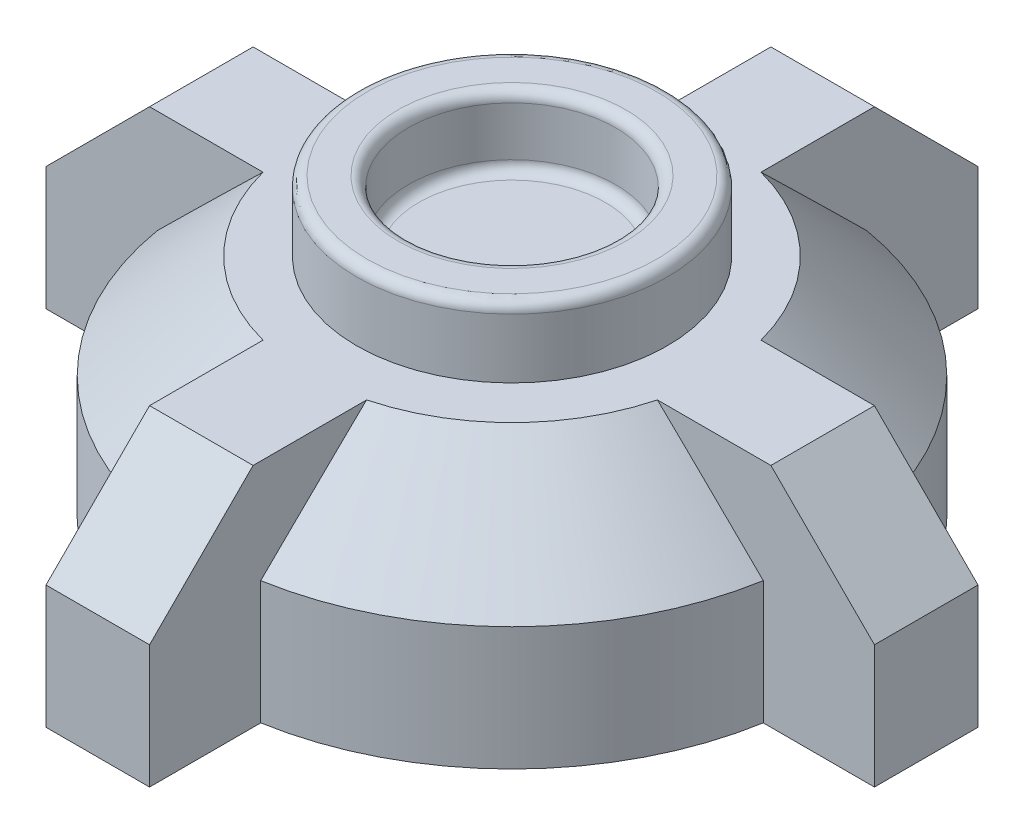
ISO-10303-21;
HEADER;
FILE_DESCRIPTION(('STEP AP214'),'2;1');
FILE_NAME('part.step','',(''),(''),'','','');
FILE_SCHEMA(('AUTOMOTIVE_DESIGN { 1 0 10303 214 1 1 1 1 }'));
ENDSEC;
DATA;
#1=APPLICATION_CONTEXT('core data for automotive mechanical design processes');
#2=APPLICATION_PROTOCOL_DEFINITION('international standard','automotive_design',2000,#1);
#3=PRODUCT_CONTEXT('',#1,'mechanical');
#4=PRODUCT('Part','Part','',(#3));
#5=PRODUCT_RELATED_PRODUCT_CATEGORY('part','',(#4));
#6=PRODUCT_DEFINITION_FORMATION('','',#4);
#7=PRODUCT_DEFINITION_CONTEXT('part definition',#1,'design');
#8=PRODUCT_DEFINITION('design','',#6,#7);
#9=PRODUCT_DEFINITION_SHAPE('','',#8);
#10=(LENGTH_UNIT() NAMED_UNIT(*) SI_UNIT(.MILLI.,.METRE.));
#11=(NAMED_UNIT(*) PLANE_ANGLE_UNIT() SI_UNIT($,.RADIAN.));
#12=(NAMED_UNIT(*) SI_UNIT($,.STERADIAN.) SOLID_ANGLE_UNIT());
#13=UNCERTAINTY_MEASURE_WITH_UNIT(LENGTH_MEASURE(1.E-05),#10,'distance_accuracy_value','');
#14=(GEOMETRIC_REPRESENTATION_CONTEXT(3) GLOBAL_UNCERTAINTY_ASSIGNED_CONTEXT((#13)) GLOBAL_UNIT_ASSIGNED_CONTEXT((#10,
#11,#12)) REPRESENTATION_CONTEXT('',''));
#15=CARTESIAN_POINT('',(0.,0.,0.));
#16=DIRECTION('',(0.,0.,1.));
#17=DIRECTION('',(1.,0.,0.));
#18=AXIS2_PLACEMENT_3D('',#15,#16,#17);
#19=CARTESIAN_POINT('',(-10.,43.8,-80.));
#20=DIRECTION('',(1.,0.,0.));
#21=DIRECTION('',(0.,0.,-1.));
#22=AXIS2_PLACEMENT_3D('',#19,#20,#21);
#23=PLANE('',#22);
#24=DIRECTION('',(0.,0.,1.));
#25=VECTOR('',#24,1.);
#26=CARTESIAN_POINT('',(-10.,43.8,-80.));
#27=LINE('',#26,#25);
#28=CARTESIAN_POINT('',(-9.99999999999999,43.8,-59.9999999999999));
#29=VERTEX_POINT('',#28);
#30=CARTESIAN_POINT('',(-9.99999999999998,43.8,-38.0876394871578));
#31=VERTEX_POINT('',#30);
#32=EDGE_CURVE('E299',#29,#31,#27,.T.);
#33=ORIENTED_EDGE('',*,*,#32,.F.);
#34=DIRECTION('',(0.,0.707106781186548,0.707106781186548));
#35=VECTOR('',#34,1.);
#36=CARTESIAN_POINT('',(-10.,23.7999999999999,-80.));
#37=LINE('',#36,#35);
#38=CARTESIAN_POINT('',(-10.,23.7999999999999,-80.));
#39=VERTEX_POINT('',#38);
#40=EDGE_CURVE('E379',#29,#39,#37,.F.);
#41=ORIENTED_EDGE('',*,*,#40,.T.);
#42=DIRECTION('',(0.,-1.,0.));
#43=VECTOR('',#42,1.);
#44=CARTESIAN_POINT('',(-10.,43.8,-80.));
#45=LINE('',#44,#43);
#46=CARTESIAN_POINT('',(-10.,0.,-80.));
#47=VERTEX_POINT('',#46);
#48=EDGE_CURVE('E236',#39,#47,#45,.T.);
#49=ORIENTED_EDGE('',*,*,#48,.T.);
#50=DIRECTION('',(0.,0.,1.));
#51=VECTOR('',#50,1.);
#52=CARTESIAN_POINT('',(-10.,0.,-80.));
#53=LINE('',#52,#51);
#54=CARTESIAN_POINT('',(-9.99999999999997,0.,-58.5304135246494));
#55=VERTEX_POINT('',#54);
#56=EDGE_CURVE('E227',#47,#55,#53,.T.);
#57=ORIENTED_EDGE('',*,*,#56,.T.);
#58=DIRECTION('',(0.,-1.,0.));
#59=VECTOR('',#58,1.);
#60=CARTESIAN_POINT('',(-9.99999999999997,43.8,-58.5304135246494));
#61=LINE('',#60,#59);
#62=CARTESIAN_POINT('',(-9.99999999999997,23.7999999999999,-58.5304135246494));
#63=VERTEX_POINT('',#62);
#64=EDGE_CURVE('E207',#63,#55,#61,.T.);
#65=ORIENTED_EDGE('',*,*,#64,.F.);
#66=CARTESIAN_POINT('',(-9.99999999999997,23.7999999999999,-58.5304135246494));
#67=CARTESIAN_POINT('',(-9.99999999999999,24.6365283418967,-57.6817613217179));
#68=CARTESIAN_POINT('',(-9.99999999999999,25.4727978790215,-56.8328540918917));
#69=CARTESIAN_POINT('',(-9.99999999999999,27.1447385041518,-55.1344502861243));
#70=CARTESIAN_POINT('',(-9.99999999999999,27.9804095920714,-54.2849537100984));
#71=CARTESIAN_POINT('',(-9.99999999999999,30.486394678089,-51.7354704283543));
#72=CARTESIAN_POINT('',(-9.99999999999999,32.1556893970012,-50.0344811448777));
#73=CARTESIAN_POINT('',(-9.99999999999998,34.6568851091216,-47.4803026533408));
#74=CARTESIAN_POINT('',(-9.99999999999998,35.4901606213447,-46.6284593583655));
#75=CARTESIAN_POINT('',(-9.99999999999998,37.1556286286314,-44.9237150114874));
#76=CARTESIAN_POINT('',(-9.99999999999998,37.9878211239959,-44.0708139598786));
#77=CARTESIAN_POINT('',(-9.99999999999998,39.6509336264807,-42.3637632627742));
#78=CARTESIAN_POINT('',(-9.99999999999998,40.4818536270643,-41.5096136109084));
#79=CARTESIAN_POINT('',(-9.99999999999998,42.1421508328372,-39.7998146880413));
#80=CARTESIAN_POINT('',(-9.99999999999998,42.9715280364976,-38.9441654155557));
#81=CARTESIAN_POINT('',(-9.99999999999998,43.8,-38.0876394871578));
#82=B_SPLINE_CURVE_WITH_KNOTS('',3,(#66,#67,#68,#69,#70,#71,#72,#73,#74,#75,#76,#77,#78,#79,#80,
#81),.UNSPECIFIED.,.F.,.F.,(4,2,2,2,2,2,2,4),(0.,3.57490007242799,7.14980065842816,
14.2995638098514,17.874456866898,21.4493489308775,25.0242592975697,28.5991732049023),.UNSPECIFIED.);
#83=EDGE_CURVE('E428',#63,#31,#82,.T.);
#84=ORIENTED_EDGE('',*,*,#83,.T.);
#85=EDGE_LOOP('',(#33,#41,#49,#57,#65,#84));
#86=FACE_BOUND('',#85,.T.);
#87=ADVANCED_FACE('F45',(#86),#23,.F.);
#88=CARTESIAN_POINT('',(0.,43.8,0.));
#89=DIRECTION('',(0.,-1.,0.));
#90=DIRECTION('',(0.,0.,-1.));
#91=AXIS2_PLACEMENT_3D('',#88,#89,#90);
#92=CYLINDRICAL_SURFACE('',#91,59.3785256415689);
#93=DIRECTION('',(0.,-1.,0.));
#94=VECTOR('',#93,1.);
#95=CARTESIAN_POINT('',(-58.5304135246494,43.8,-10.));
#96=LINE('',#95,#94);
#97=CARTESIAN_POINT('',(-58.5304135246494,23.7999999999999,-10.));
#98=VERTEX_POINT('',#97);
#99=CARTESIAN_POINT('',(-58.5304135246494,0.,-10.));
#100=VERTEX_POINT('',#99);
#101=EDGE_CURVE('E221',#98,#100,#96,.T.);
#102=ORIENTED_EDGE('',*,*,#101,.F.);
#103=CARTESIAN_POINT('',(0.,23.7999999999999,0.));
#104=DIRECTION('',(0.,1.,0.));
#105=DIRECTION('',(0.,0.,1.));
#106=AXIS2_PLACEMENT_3D('',#103,#104,#105);
#107=CIRCLE('',#106,59.3785256415689);
#108=EDGE_CURVE('E214',#98,#63,#107,.F.);
#109=ORIENTED_EDGE('',*,*,#108,.T.);
#110=ORIENTED_EDGE('',*,*,#64,.T.);
#111=CARTESIAN_POINT('',(0.,0.,0.));
#112=DIRECTION('',(0.,1.,0.));
#113=DIRECTION('',(0.,0.,1.));
#114=AXIS2_PLACEMENT_3D('',#111,#112,#113);
#115=CIRCLE('',#114,59.3785256415689);
#116=EDGE_CURVE('E211',#55,#100,#115,.T.);
#117=ORIENTED_EDGE('',*,*,#116,.T.);
#118=EDGE_LOOP('',(#102,#109,#110,#117));
#119=FACE_BOUND('',#118,.T.);
#120=ADVANCED_FACE('F210',(#119),#92,.T.);
#121=CARTESIAN_POINT('',(-80.,43.8,-10.));
#122=DIRECTION('',(0.,0.,-1.));
#123=DIRECTION('',(-1.,0.,0.));
#124=AXIS2_PLACEMENT_3D('',#121,#122,#123);
#125=PLANE('',#124);
#126=DIRECTION('',(0.,-1.,0.));
#127=VECTOR('',#126,1.);
#128=CARTESIAN_POINT('',(-80.,43.8,-10.));
#129=LINE('',#128,#127);
#130=CARTESIAN_POINT('',(-80.,23.7999999999999,-10.));
#131=VERTEX_POINT('',#130);
#132=CARTESIAN_POINT('',(-80.,0.,-10.));
#133=VERTEX_POINT('',#132);
#134=EDGE_CURVE('E338',#131,#133,#129,.T.);
#135=ORIENTED_EDGE('',*,*,#134,.F.);
#136=DIRECTION('',(-0.707106781186548,-0.707106781186548,0.));
#137=VECTOR('',#136,1.);
#138=CARTESIAN_POINT('',(-70.,33.7999999999999,-10.));
#139=LINE('',#138,#137);
#140=CARTESIAN_POINT('',(-59.9999999999999,43.8,-10.));
#141=VERTEX_POINT('',#140);
#142=EDGE_CURVE('E388',#131,#141,#139,.F.);
#143=ORIENTED_EDGE('',*,*,#142,.T.);
#144=DIRECTION('',(1.,0.,0.));
#145=VECTOR('',#144,1.);
#146=CARTESIAN_POINT('',(-80.,43.8,-10.));
#147=LINE('',#146,#145);
#148=CARTESIAN_POINT('',(-38.0876394871578,43.8,-10.));
#149=VERTEX_POINT('',#148);
#150=EDGE_CURVE('E605',#141,#149,#147,.T.);
#151=ORIENTED_EDGE('',*,*,#150,.T.);
#152=CARTESIAN_POINT('',(-38.0876394871578,43.8,-10.));
#153=CARTESIAN_POINT('',(-38.9441654155556,42.9715280364976,-10.));
#154=CARTESIAN_POINT('',(-39.7998146880413,42.1421508328372,-10.));
#155=CARTESIAN_POINT('',(-41.5096136109084,40.4818536270644,-10.));
#156=CARTESIAN_POINT('',(-42.3637632627742,39.6509336264807,-10.));
#157=CARTESIAN_POINT('',(-44.0708139598786,37.9878211239959,-10.));
#158=CARTESIAN_POINT('',(-44.9237150114874,37.1556286286314,-10.));
#159=CARTESIAN_POINT('',(-46.6284593583655,35.4901606213447,-10.));
#160=CARTESIAN_POINT('',(-47.4803026533408,34.6568851091216,-10.));
#161=CARTESIAN_POINT('',(-50.0344811448777,32.1556893970012,-10.));
#162=CARTESIAN_POINT('',(-51.7354704283543,30.486394678089,-10.));
#163=CARTESIAN_POINT('',(-54.2849537100984,27.9804095920714,-10.));
#164=CARTESIAN_POINT('',(-55.1344502861243,27.1447385041518,-10.));
#165=CARTESIAN_POINT('',(-56.8328540918917,25.4727978790215,-10.));
#166=CARTESIAN_POINT('',(-57.6817613217179,24.6365283418967,-10.));
#167=CARTESIAN_POINT('',(-58.5304135246494,23.7999999999999,-10.));
#168=B_SPLINE_CURVE_WITH_KNOTS('',3,(#152,#153,#154,#155,#156,#157,#158,#159,#160,#161,#162,
#163,#164,#165,#166,#167),.UNSPECIFIED.,.F.,.F.,(4,2,2,2,2,2,2,4),(0.,3.57491390733256,
7.14982427402479,10.7247163380043,14.2996093950509,21.4493725464741,25.0242731324743,
28.5991732049023),.UNSPECIFIED.);
#169=EDGE_CURVE('E419',#149,#98,#168,.T.);
#170=ORIENTED_EDGE('',*,*,#169,.T.);
#171=ORIENTED_EDGE('',*,*,#101,.T.);
#172=DIRECTION('',(1.,0.,0.));
#173=VECTOR('',#172,1.);
#174=CARTESIAN_POINT('',(-80.,0.,-10.));
#175=LINE('',#174,#173);
#176=EDGE_CURVE('E231',#133,#100,#175,.T.);
#177=ORIENTED_EDGE('',*,*,#176,.F.);
#178=EDGE_LOOP('',(#135,#143,#151,#170,#171,#177));
#179=FACE_BOUND('',#178,.T.);
#180=ADVANCED_FACE('F440',(#179),#125,.T.);
#181=CARTESIAN_POINT('',(-80.,43.8,10.));
#182=DIRECTION('',(-1.,0.,0.));
#183=DIRECTION('',(0.,0.,1.));
#184=AXIS2_PLACEMENT_3D('',#181,#182,#183);
#185=PLANE('',#184);
#186=DIRECTION('',(0.,-1.,0.));
#187=VECTOR('',#186,1.);
#188=CARTESIAN_POINT('',(-80.,43.8,10.));
#189=LINE('',#188,#187);
#190=CARTESIAN_POINT('',(-80.,23.7999999999999,10.));
#191=VERTEX_POINT('',#190);
#192=CARTESIAN_POINT('',(-80.,0.,10.));
#193=VERTEX_POINT('',#192);
#194=EDGE_CURVE('E335',#191,#193,#189,.T.);
#195=ORIENTED_EDGE('',*,*,#194,.F.);
#196=DIRECTION('',(0.,0.,-1.));
#197=VECTOR('',#196,1.);
#198=CARTESIAN_POINT('',(-80.,23.7999999999999,10.));
#199=LINE('',#198,#197);
#200=EDGE_CURVE('E384',#191,#131,#199,.T.);
#201=ORIENTED_EDGE('',*,*,#200,.T.);
#202=ORIENTED_EDGE('',*,*,#134,.T.);
#203=DIRECTION('',(0.,0.,-1.));
#204=VECTOR('',#203,1.);
#205=CARTESIAN_POINT('',(-80.,0.,10.));
#206=LINE('',#205,#204);
#207=EDGE_CURVE('E249',#193,#133,#206,.T.);
#208=ORIENTED_EDGE('',*,*,#207,.F.);
#209=EDGE_LOOP('',(#195,#201,#202,#208));
#210=FACE_BOUND('',#209,.T.);
#211=ADVANCED_FACE('F445',(#210),#185,.T.);
#212=CARTESIAN_POINT('',(-80.,43.8,10.));
#213=DIRECTION('',(0.,0.,-1.));
#214=DIRECTION('',(-1.,0.,0.));
#215=AXIS2_PLACEMENT_3D('',#212,#213,#214);
#216=PLANE('',#215);
#217=DIRECTION('',(1.,0.,0.));
#218=VECTOR('',#217,1.);
#219=CARTESIAN_POINT('',(-80.,43.8,10.));
#220=LINE('',#219,#218);
#221=CARTESIAN_POINT('',(-59.9999999999999,43.8,10.));
#222=VERTEX_POINT('',#221);
#223=CARTESIAN_POINT('',(-38.0876394871577,43.8,10.));
#224=VERTEX_POINT('',#223);
#225=EDGE_CURVE('E596',#222,#224,#220,.T.);
#226=ORIENTED_EDGE('',*,*,#225,.F.);
#227=DIRECTION('',(0.707106781186548,0.707106781186548,0.));
#228=VECTOR('',#227,1.);
#229=CARTESIAN_POINT('',(-80.,23.7999999999999,10.));
#230=LINE('',#229,#228);
#231=EDGE_CURVE('E391',#222,#191,#230,.F.);
#232=ORIENTED_EDGE('',*,*,#231,.T.);
#233=ORIENTED_EDGE('',*,*,#194,.T.);
#234=DIRECTION('',(1.,0.,0.));
#235=VECTOR('',#234,1.);
#236=CARTESIAN_POINT('',(-80.,0.,10.));
#237=LINE('',#236,#235);
#238=CARTESIAN_POINT('',(-58.5304135246494,0.,10.));
#239=VERTEX_POINT('',#238);
#240=EDGE_CURVE('E252',#193,#239,#237,.T.);
#241=ORIENTED_EDGE('',*,*,#240,.T.);
#242=DIRECTION('',(0.,-1.,0.));
#243=VECTOR('',#242,1.);
#244=CARTESIAN_POINT('',(-58.5304135246494,43.8,10.));
#245=LINE('',#244,#243);
#246=CARTESIAN_POINT('',(-58.5304135246494,23.7999999999999,10.));
#247=VERTEX_POINT('',#246);
#248=EDGE_CURVE('E332',#247,#239,#245,.T.);
#249=ORIENTED_EDGE('',*,*,#248,.F.);
#250=CARTESIAN_POINT('',(-58.5304135246494,23.7999999999999,10.));
#251=CARTESIAN_POINT('',(-57.6817613217179,24.6365283418967,10.));
#252=CARTESIAN_POINT('',(-56.8328540918917,25.4727978790215,10.));
#253=CARTESIAN_POINT('',(-55.1344502861243,27.1447385041518,10.));
#254=CARTESIAN_POINT('',(-54.2849537100984,27.9804095920714,10.));
#255=CARTESIAN_POINT('',(-51.7354704283543,30.486394678089,10.));
#256=CARTESIAN_POINT('',(-50.0344811448777,32.1556893970012,10.));
#257=CARTESIAN_POINT('',(-47.4803026533408,34.6568851091216,10.));
#258=CARTESIAN_POINT('',(-46.6284593583654,35.4901606213447,10.));
#259=CARTESIAN_POINT('',(-44.9237150114874,37.1556286286314,10.));
#260=CARTESIAN_POINT('',(-44.0708139598786,37.9878211239959,10.));
#261=CARTESIAN_POINT('',(-42.3637632627742,39.6509336264807,10.));
#262=CARTESIAN_POINT('',(-41.5096136109084,40.4818536270644,10.));
#263=CARTESIAN_POINT('',(-39.7998146880413,42.1421508328372,10.));
#264=CARTESIAN_POINT('',(-38.9441654155556,42.9715280364976,10.));
#265=CARTESIAN_POINT('',(-38.0876394871577,43.8,10.));
#266=B_SPLINE_CURVE_WITH_KNOTS('',3,(#250,#251,#252,#253,#254,#255,#256,#257,#258,#259,#260,
#261,#262,#263,#264,#265),.UNSPECIFIED.,.F.,.F.,(4,2,2,2,2,2,2,4),(0.,3.57490007242799,
7.14980065842817,14.2995638098514,17.874456866898,21.4493489308775,25.0242592975698,
28.5991732049023),.UNSPECIFIED.);
#267=EDGE_CURVE('E542',#247,#224,#266,.T.);
#268=ORIENTED_EDGE('',*,*,#267,.T.);
#269=EDGE_LOOP('',(#226,#232,#233,#241,#249,#268));
#270=FACE_BOUND('',#269,.T.);
#271=ADVANCED_FACE('F585',(#270),#216,.F.);
#272=CARTESIAN_POINT('',(0.,43.8,0.));
#273=DIRECTION('',(0.,-1.,0.));
#274=DIRECTION('',(0.,0.,-1.));
#275=AXIS2_PLACEMENT_3D('',#272,#273,#274);
#276=CYLINDRICAL_SURFACE('',#275,59.3785256415689);
#277=DIRECTION('',(0.,-1.,0.));
#278=VECTOR('',#277,1.);
#279=CARTESIAN_POINT('',(-10.,43.8,58.5304135246494));
#280=LINE('',#279,#278);
#281=CARTESIAN_POINT('',(-10.,23.7999999999999,58.5304135246494));
#282=VERTEX_POINT('',#281);
#283=CARTESIAN_POINT('',(-10.,0.,58.5304135246494));
#284=VERTEX_POINT('',#283);
#285=EDGE_CURVE('E329',#282,#284,#280,.T.);
#286=ORIENTED_EDGE('',*,*,#285,.F.);
#287=CARTESIAN_POINT('',(0.,23.7999999999999,0.));
#288=DIRECTION('',(0.,1.,0.));
#289=DIRECTION('',(0.,0.,1.));
#290=AXIS2_PLACEMENT_3D('',#287,#288,#289);
#291=CIRCLE('',#290,59.3785256415689);
#292=EDGE_CURVE('E394',#282,#247,#291,.F.);
#293=ORIENTED_EDGE('',*,*,#292,.T.);
#294=ORIENTED_EDGE('',*,*,#248,.T.);
#295=CARTESIAN_POINT('',(0.,0.,0.));
#296=DIRECTION('',(0.,1.,0.));
#297=DIRECTION('',(0.,0.,1.));
#298=AXIS2_PLACEMENT_3D('',#295,#296,#297);
#299=CIRCLE('',#298,59.3785256415689);
#300=EDGE_CURVE('E256',#239,#284,#299,.T.);
#301=ORIENTED_EDGE('',*,*,#300,.T.);
#302=EDGE_LOOP('',(#286,#293,#294,#301));
#303=FACE_BOUND('',#302,.T.);
#304=ADVANCED_FACE('F582',(#303),#276,.T.);
#305=CARTESIAN_POINT('',(-9.99999999999999,43.8,58.5304135246494));
#306=DIRECTION('',(1.,0.,0.));
#307=DIRECTION('',(0.,0.,-1.));
#308=AXIS2_PLACEMENT_3D('',#305,#306,#307);
#309=PLANE('',#308);
#310=DIRECTION('',(0.,-1.,0.));
#311=VECTOR('',#310,1.);
#312=CARTESIAN_POINT('',(-9.99999999999999,43.8,80.));
#313=LINE('',#312,#311);
#314=CARTESIAN_POINT('',(-9.99999999999999,23.7999999999999,80.));
#315=VERTEX_POINT('',#314);
#316=CARTESIAN_POINT('',(-9.99999999999999,0.,80.));
#317=VERTEX_POINT('',#316);
#318=EDGE_CURVE('E326',#315,#317,#313,.T.);
#319=ORIENTED_EDGE('',*,*,#318,.F.);
#320=DIRECTION('',(0.,0.707106781186548,-0.707106781186548));
#321=VECTOR('',#320,1.);
#322=CARTESIAN_POINT('',(-9.99999999999999,43.8,59.9999999999999));
#323=LINE('',#322,#321);
#324=CARTESIAN_POINT('',(-9.99999999999999,43.8,59.9999999999999));
#325=VERTEX_POINT('',#324);
#326=EDGE_CURVE('E416',#315,#325,#323,.T.);
#327=ORIENTED_EDGE('',*,*,#326,.T.);
#328=DIRECTION('',(0.,0.,1.));
#329=VECTOR('',#328,1.);
#330=CARTESIAN_POINT('',(-9.99999999999999,43.8,58.5304135246494));
#331=LINE('',#330,#329);
#332=CARTESIAN_POINT('',(-10.,43.8,38.0876394871577));
#333=VERTEX_POINT('',#332);
#334=EDGE_CURVE('E604',#333,#325,#331,.T.);
#335=ORIENTED_EDGE('',*,*,#334,.F.);
#336=CARTESIAN_POINT('',(-10.,43.8,38.0876394871577));
#337=CARTESIAN_POINT('',(-9.99999999999999,42.9715280364976,38.9441654155556));
#338=CARTESIAN_POINT('',(-9.99999999999999,42.1421508328372,39.7998146880413));
#339=CARTESIAN_POINT('',(-9.99999999999999,40.4818536270644,41.5096136109084));
#340=CARTESIAN_POINT('',(-9.99999999999999,39.6509336264807,42.3637632627742));
#341=CARTESIAN_POINT('',(-9.99999999999999,37.9878211239959,44.0708139598786));
#342=CARTESIAN_POINT('',(-9.99999999999999,37.1556286286314,44.9237150114874));
#343=CARTESIAN_POINT('',(-9.99999999999999,35.4901606213447,46.6284593583654));
#344=CARTESIAN_POINT('',(-9.99999999999999,34.6568851091216,47.4803026533408));
#345=CARTESIAN_POINT('',(-9.99999999999999,32.1556893970012,50.0344811448777));
#346=CARTESIAN_POINT('',(-9.99999999999999,30.4863946780889,51.7354704283543));
#347=CARTESIAN_POINT('',(-9.99999999999999,27.9804095920714,54.2849537100984));
#348=CARTESIAN_POINT('',(-9.99999999999999,27.1447385041518,55.1344502861243));
#349=CARTESIAN_POINT('',(-9.99999999999999,25.4727978790215,56.8328540918917));
#350=CARTESIAN_POINT('',(-9.99999999999999,24.6365283418967,57.6817613217179));
#351=CARTESIAN_POINT('',(-9.99999999999999,23.7999999999999,58.5304135246494));
#352=B_SPLINE_CURVE_WITH_KNOTS('',3,(#336,#337,#338,#339,#340,#341,#342,#343,#344,#345,#346,
#347,#348,#349,#350,#351),.UNSPECIFIED.,.F.,.F.,(4,2,2,2,2,2,2,4),(0.,3.57491390733256,
7.1498242740248,10.7247163380043,14.2996093950509,21.4493725464742,25.0242731324743,
28.5991732049023),.UNSPECIFIED.);
#353=EDGE_CURVE('E569',#333,#282,#352,.T.);
#354=ORIENTED_EDGE('',*,*,#353,.T.);
#355=ORIENTED_EDGE('',*,*,#285,.T.);
#356=DIRECTION('',(0.,0.,1.));
#357=VECTOR('',#356,1.);
#358=CARTESIAN_POINT('',(-9.99999999999999,0.,58.5304135246494));
#359=LINE('',#358,#357);
#360=EDGE_CURVE('E260',#284,#317,#359,.T.);
#361=ORIENTED_EDGE('',*,*,#360,.T.);
#362=EDGE_LOOP('',(#319,#327,#335,#354,#355,#361));
#363=FACE_BOUND('',#362,.T.);
#364=ADVANCED_FACE('F576',(#363),#309,.F.);
#365=CARTESIAN_POINT('',(-9.99999999999999,43.8,80.));
#366=DIRECTION('',(0.,0.,-1.));
#367=DIRECTION('',(-1.,0.,0.));
#368=AXIS2_PLACEMENT_3D('',#365,#366,#367);
#369=PLANE('',#368);
#370=DIRECTION('',(0.,-1.,0.));
#371=VECTOR('',#370,1.);
#372=CARTESIAN_POINT('',(10.,43.8,80.));
#373=LINE('',#372,#371);
#374=CARTESIAN_POINT('',(10.,23.7999999999999,80.));
#375=VERTEX_POINT('',#374);
#376=CARTESIAN_POINT('',(10.,0.,80.));
#377=VERTEX_POINT('',#376);
#378=EDGE_CURVE('E323',#375,#377,#373,.T.);
#379=ORIENTED_EDGE('',*,*,#378,.F.);
#380=DIRECTION('',(-1.,0.,0.));
#381=VECTOR('',#380,1.);
#382=CARTESIAN_POINT('',(-9.99999999999999,23.7999999999999,80.));
#383=LINE('',#382,#381);
#384=EDGE_CURVE('E61',#375,#315,#383,.T.);
#385=ORIENTED_EDGE('',*,*,#384,.T.);
#386=ORIENTED_EDGE('',*,*,#318,.T.);
#387=DIRECTION('',(1.,0.,0.));
#388=VECTOR('',#387,1.);
#389=CARTESIAN_POINT('',(-9.99999999999999,0.,80.));
#390=LINE('',#389,#388);
#391=EDGE_CURVE('E264',#317,#377,#390,.T.);
#392=ORIENTED_EDGE('',*,*,#391,.T.);
#393=EDGE_LOOP('',(#379,#385,#386,#392));
#394=FACE_BOUND('',#393,.T.);
#395=ADVANCED_FACE('F581',(#394),#369,.F.);
#396=CARTESIAN_POINT('',(10.,43.8,58.5304135246494));
#397=DIRECTION('',(1.,0.,0.));
#398=DIRECTION('',(0.,0.,-1.));
#399=AXIS2_PLACEMENT_3D('',#396,#397,#398);
#400=PLANE('',#399);
#401=DIRECTION('',(0.,0.,1.));
#402=VECTOR('',#401,1.);
#403=CARTESIAN_POINT('',(10.,43.8,58.5304135246494));
#404=LINE('',#403,#402);
#405=CARTESIAN_POINT('',(10.,43.8,38.0876394871577));
#406=VERTEX_POINT('',#405);
#407=CARTESIAN_POINT('',(10.,43.8,59.9999999999999));
#408=VERTEX_POINT('',#407);
#409=EDGE_CURVE('E628',#406,#408,#404,.T.);
#410=ORIENTED_EDGE('',*,*,#409,.T.);
#411=DIRECTION('',(0.,-0.707106781186548,0.707106781186548));
#412=VECTOR('',#411,1.);
#413=CARTESIAN_POINT('',(10.,44.5347932376753,59.2652067623247));
#414=LINE('',#413,#412);
#415=EDGE_CURVE('E69',#408,#375,#414,.T.);
#416=ORIENTED_EDGE('',*,*,#415,.T.);
#417=ORIENTED_EDGE('',*,*,#378,.T.);
#418=DIRECTION('',(0.,0.,1.));
#419=VECTOR('',#418,1.);
#420=CARTESIAN_POINT('',(10.,0.,58.5304135246494));
#421=LINE('',#420,#419);
#422=CARTESIAN_POINT('',(10.,0.,58.5304135246494));
#423=VERTEX_POINT('',#422);
#424=EDGE_CURVE('E268',#423,#377,#421,.T.);
#425=ORIENTED_EDGE('',*,*,#424,.F.);
#426=DIRECTION('',(0.,-1.,0.));
#427=VECTOR('',#426,1.);
#428=CARTESIAN_POINT('',(10.,43.8,58.5304135246494));
#429=LINE('',#428,#427);
#430=CARTESIAN_POINT('',(10.,23.7999999999999,58.5304135246494));
#431=VERTEX_POINT('',#430);
#432=EDGE_CURVE('E320',#431,#423,#429,.T.);
#433=ORIENTED_EDGE('',*,*,#432,.F.);
#434=CARTESIAN_POINT('',(10.,23.7999999999999,58.5304135246494));
#435=CARTESIAN_POINT('',(10.,24.6365283418967,57.6817613217179));
#436=CARTESIAN_POINT('',(10.,25.4727978790215,56.8328540918917));
#437=CARTESIAN_POINT('',(10.,27.1447385041518,55.1344502861243));
#438=CARTESIAN_POINT('',(10.,27.9804095920714,54.2849537100984));
#439=CARTESIAN_POINT('',(10.,30.486394678089,51.7354704283543));
#440=CARTESIAN_POINT('',(10.,32.1556893970012,50.0344811448777));
#441=CARTESIAN_POINT('',(10.,34.6568851091216,47.4803026533408));
#442=CARTESIAN_POINT('',(10.,35.4901606213447,46.6284593583654));
#443=CARTESIAN_POINT('',(10.,37.1556286286314,44.9237150114874));
#444=CARTESIAN_POINT('',(10.,37.9878211239959,44.0708139598786));
#445=CARTESIAN_POINT('',(10.,39.6509336264807,42.3637632627742));
#446=CARTESIAN_POINT('',(10.,40.4818536270644,41.5096136109084));
#447=CARTESIAN_POINT('',(10.,42.1421508328372,39.7998146880413));
#448=CARTESIAN_POINT('',(10.,42.9715280364976,38.9441654155556));
#449=CARTESIAN_POINT('',(10.,43.8,38.0876394871578));
#450=B_SPLINE_CURVE_WITH_KNOTS('',3,(#434,#435,#436,#437,#438,#439,#440,#441,#442,#443,#444,
#445,#446,#447,#448,#449),.UNSPECIFIED.,.F.,.F.,(4,2,2,2,2,2,2,4),(0.,3.57490007242799,
7.14980065842817,14.2995638098514,17.874456866898,21.4493489308775,25.0242592975697,
28.5991732049023),.UNSPECIFIED.);
#451=EDGE_CURVE('E500',#431,#406,#450,.T.);
#452=ORIENTED_EDGE('',*,*,#451,.T.);
#453=EDGE_LOOP('',(#410,#416,#417,#425,#433,#452));
#454=FACE_BOUND('',#453,.T.);
#455=ADVANCED_FACE('F661',(#454),#400,.T.);
#456=CARTESIAN_POINT('',(0.,43.8,0.));
#457=DIRECTION('',(0.,-1.,0.));
#458=DIRECTION('',(0.,0.,-1.));
#459=AXIS2_PLACEMENT_3D('',#456,#457,#458);
#460=CYLINDRICAL_SURFACE('',#459,59.3785256415689);
#461=DIRECTION('',(0.,-1.,0.));
#462=VECTOR('',#461,1.);
#463=CARTESIAN_POINT('',(58.5304135246494,43.8,10.));
#464=LINE('',#463,#462);
#465=CARTESIAN_POINT('',(58.5304135246494,23.7999999999999,10.));
#466=VERTEX_POINT('',#465);
#467=CARTESIAN_POINT('',(58.5304135246494,0.,10.));
#468=VERTEX_POINT('',#467);
#469=EDGE_CURVE('E317',#466,#468,#464,.T.);
#470=ORIENTED_EDGE('',*,*,#469,.F.);
#471=CARTESIAN_POINT('',(0.,23.7999999999999,0.));
#472=DIRECTION('',(0.,1.,0.));
#473=DIRECTION('',(0.,0.,1.));
#474=AXIS2_PLACEMENT_3D('',#471,#472,#473);
#475=CIRCLE('',#474,59.3785256415689);
#476=EDGE_CURVE('E397',#466,#431,#475,.F.);
#477=ORIENTED_EDGE('',*,*,#476,.T.);
#478=ORIENTED_EDGE('',*,*,#432,.T.);
#479=CARTESIAN_POINT('',(0.,0.,0.));
#480=DIRECTION('',(0.,1.,0.));
#481=DIRECTION('',(0.,0.,1.));
#482=AXIS2_PLACEMENT_3D('',#479,#480,#481);
#483=CIRCLE('',#482,59.3785256415689);
#484=EDGE_CURVE('E272',#423,#468,#483,.T.);
#485=ORIENTED_EDGE('',*,*,#484,.T.);
#486=EDGE_LOOP('',(#470,#477,#478,#485));
#487=FACE_BOUND('',#486,.T.);
#488=ADVANCED_FACE('F531',(#487),#460,.T.);
#489=CARTESIAN_POINT('',(58.5304135246494,43.8,10.));
#490=DIRECTION('',(0.,0.,-1.));
#491=DIRECTION('',(-1.,0.,0.));
#492=AXIS2_PLACEMENT_3D('',#489,#490,#491);
#493=PLANE('',#492);
#494=DIRECTION('',(0.,-1.,0.));
#495=VECTOR('',#494,1.);
#496=CARTESIAN_POINT('',(80.,43.8,10.));
#497=LINE('',#496,#495);
#498=CARTESIAN_POINT('',(80.,23.7999999999999,10.));
#499=VERTEX_POINT('',#498);
#500=CARTESIAN_POINT('',(80.,0.,10.));
#501=VERTEX_POINT('',#500);
#502=EDGE_CURVE('E314',#499,#501,#497,.T.);
#503=ORIENTED_EDGE('',*,*,#502,.F.);
#504=DIRECTION('',(-0.707106781186548,0.707106781186548,0.));
#505=VECTOR('',#504,1.);
#506=CARTESIAN_POINT('',(59.9999999999999,43.8,10.));
#507=LINE('',#506,#505);
#508=CARTESIAN_POINT('',(59.9999999999999,43.8,10.));
#509=VERTEX_POINT('',#508);
#510=EDGE_CURVE('E409',#499,#509,#507,.T.);
#511=ORIENTED_EDGE('',*,*,#510,.T.);
#512=DIRECTION('',(1.,0.,0.));
#513=VECTOR('',#512,1.);
#514=CARTESIAN_POINT('',(58.5304135246494,43.8,10.));
#515=LINE('',#514,#513);
#516=CARTESIAN_POINT('',(38.0876394871577,43.8,10.));
#517=VERTEX_POINT('',#516);
#518=EDGE_CURVE('E625',#517,#509,#515,.T.);
#519=ORIENTED_EDGE('',*,*,#518,.F.);
#520=CARTESIAN_POINT('',(38.0876394871577,43.8,10.));
#521=CARTESIAN_POINT('',(38.9441654155556,42.9715280364976,10.));
#522=CARTESIAN_POINT('',(39.7998146880413,42.1421508328372,10.));
#523=CARTESIAN_POINT('',(41.5096136109084,40.4818536270644,10.));
#524=CARTESIAN_POINT('',(42.3637632627742,39.6509336264807,10.));
#525=CARTESIAN_POINT('',(44.0708139598786,37.9878211239959,10.));
#526=CARTESIAN_POINT('',(44.9237150114874,37.1556286286314,10.));
#527=CARTESIAN_POINT('',(46.6284593583655,35.4901606213447,10.));
#528=CARTESIAN_POINT('',(47.4803026533408,34.6568851091216,10.));
#529=CARTESIAN_POINT('',(50.0344811448777,32.1556893970012,10.));
#530=CARTESIAN_POINT('',(51.7354704283543,30.486394678089,10.));
#531=CARTESIAN_POINT('',(54.2849537100984,27.9804095920714,10.));
#532=CARTESIAN_POINT('',(55.1344502861243,27.1447385041518,10.));
#533=CARTESIAN_POINT('',(56.8328540918917,25.4727978790215,10.));
#534=CARTESIAN_POINT('',(57.6817613217179,24.6365283418967,10.));
#535=CARTESIAN_POINT('',(58.5304135246494,23.7999999999999,10.));
#536=B_SPLINE_CURVE_WITH_KNOTS('',3,(#520,#521,#522,#523,#524,#525,#526,#527,#528,#529,#530,
#531,#532,#533,#534,#535),.UNSPECIFIED.,.F.,.F.,(4,2,2,2,2,2,2,4),(0.,3.57491390733256,
7.14982427402479,10.7247163380043,14.2996093950509,21.4493725464741,25.0242731324743,
28.5991732049023),.UNSPECIFIED.);
#537=EDGE_CURVE('E535',#517,#466,#536,.T.);
#538=ORIENTED_EDGE('',*,*,#537,.T.);
#539=ORIENTED_EDGE('',*,*,#469,.T.);
#540=DIRECTION('',(1.,0.,0.));
#541=VECTOR('',#540,1.);
#542=CARTESIAN_POINT('',(58.5304135246494,0.,10.));
#543=LINE('',#542,#541);
#544=EDGE_CURVE('E276',#468,#501,#543,.T.);
#545=ORIENTED_EDGE('',*,*,#544,.T.);
#546=EDGE_LOOP('',(#503,#511,#519,#538,#539,#545));
#547=FACE_BOUND('',#546,.T.);
#548=ADVANCED_FACE('F526',(#547),#493,.F.);
#549=CARTESIAN_POINT('',(80.,43.8,10.));
#550=DIRECTION('',(-1.,0.,0.));
#551=DIRECTION('',(0.,0.,1.));
#552=AXIS2_PLACEMENT_3D('',#549,#550,#551);
#553=PLANE('',#552);
#554=DIRECTION('',(0.,-1.,0.));
#555=VECTOR('',#554,1.);
#556=CARTESIAN_POINT('',(80.,43.8,-10.));
#557=LINE('',#556,#555);
#558=CARTESIAN_POINT('',(80.,23.7999999999999,-10.));
#559=VERTEX_POINT('',#558);
#560=CARTESIAN_POINT('',(80.,0.,-10.));
#561=VERTEX_POINT('',#560);
#562=EDGE_CURVE('E311',#559,#561,#557,.T.);
#563=ORIENTED_EDGE('',*,*,#562,.F.);
#564=DIRECTION('',(0.,0.,1.));
#565=VECTOR('',#564,1.);
#566=CARTESIAN_POINT('',(80.,23.7999999999999,10.));
#567=LINE('',#566,#565);
#568=EDGE_CURVE('E406',#559,#499,#567,.T.);
#569=ORIENTED_EDGE('',*,*,#568,.T.);
#570=ORIENTED_EDGE('',*,*,#502,.T.);
#571=DIRECTION('',(0.,0.,-1.));
#572=VECTOR('',#571,1.);
#573=CARTESIAN_POINT('',(80.,0.,10.));
#574=LINE('',#573,#572);
#575=EDGE_CURVE('E280',#501,#561,#574,.T.);
#576=ORIENTED_EDGE('',*,*,#575,.T.);
#577=EDGE_LOOP('',(#563,#569,#570,#576));
#578=FACE_BOUND('',#577,.T.);
#579=ADVANCED_FACE('F523',(#578),#553,.F.);
#580=CARTESIAN_POINT('',(58.5304135246494,43.8,-10.));
#581=DIRECTION('',(0.,0.,-1.));
#582=DIRECTION('',(-1.,0.,0.));
#583=AXIS2_PLACEMENT_3D('',#580,#581,#582);
#584=PLANE('',#583);
#585=DIRECTION('',(1.,0.,0.));
#586=VECTOR('',#585,1.);
#587=CARTESIAN_POINT('',(58.5304135246494,43.8,-10.));
#588=LINE('',#587,#586);
#589=CARTESIAN_POINT('',(38.0876394871578,43.8,-10.));
#590=VERTEX_POINT('',#589);
#591=CARTESIAN_POINT('',(59.9999999999999,43.8,-10.));
#592=VERTEX_POINT('',#591);
#593=EDGE_CURVE('E623',#590,#592,#588,.T.);
#594=ORIENTED_EDGE('',*,*,#593,.T.);
#595=DIRECTION('',(0.707106781186548,-0.707106781186548,0.));
#596=VECTOR('',#595,1.);
#597=CARTESIAN_POINT('',(59.2652067623247,44.5347932376753,-10.));
#598=LINE('',#597,#596);
#599=EDGE_CURVE('E403',#592,#559,#598,.T.);
#600=ORIENTED_EDGE('',*,*,#599,.T.);
#601=ORIENTED_EDGE('',*,*,#562,.T.);
#602=DIRECTION('',(1.,0.,0.));
#603=VECTOR('',#602,1.);
#604=CARTESIAN_POINT('',(58.5304135246494,0.,-10.));
#605=LINE('',#604,#603);
#606=CARTESIAN_POINT('',(58.5304135246494,0.,-10.));
#607=VERTEX_POINT('',#606);
#608=EDGE_CURVE('E284',#607,#561,#605,.T.);
#609=ORIENTED_EDGE('',*,*,#608,.F.);
#610=DIRECTION('',(0.,-1.,0.));
#611=VECTOR('',#610,1.);
#612=CARTESIAN_POINT('',(58.5304135246494,43.8,-10.));
#613=LINE('',#612,#611);
#614=CARTESIAN_POINT('',(58.5304135246494,23.7999999999999,-10.));
#615=VERTEX_POINT('',#614);
#616=EDGE_CURVE('E308',#615,#607,#613,.T.);
#617=ORIENTED_EDGE('',*,*,#616,.F.);
#618=CARTESIAN_POINT('',(58.5304135246494,23.7999999999999,-10.));
#619=CARTESIAN_POINT('',(57.6817613217179,24.6365283418967,-10.));
#620=CARTESIAN_POINT('',(56.8328540918917,25.4727978790215,-10.));
#621=CARTESIAN_POINT('',(55.1344502861243,27.1447385041518,-10.));
#622=CARTESIAN_POINT('',(54.2849537100984,27.9804095920714,-10.));
#623=CARTESIAN_POINT('',(51.7354704283543,30.486394678089,-10.));
#624=CARTESIAN_POINT('',(50.0344811448777,32.1556893970012,-10.));
#625=CARTESIAN_POINT('',(47.4803026533408,34.6568851091217,-10.));
#626=CARTESIAN_POINT('',(46.6284593583654,35.4901606213447,-10.));
#627=CARTESIAN_POINT('',(44.9237150114874,37.1556286286314,-10.));
#628=CARTESIAN_POINT('',(44.0708139598786,37.9878211239959,-10.));
#629=CARTESIAN_POINT('',(42.3637632627742,39.6509336264807,-10.));
#630=CARTESIAN_POINT('',(41.5096136109084,40.4818536270644,-10.));
#631=CARTESIAN_POINT('',(39.7998146880413,42.1421508328372,-10.));
#632=CARTESIAN_POINT('',(38.9441654155556,42.9715280364976,-10.));
#633=CARTESIAN_POINT('',(38.0876394871578,43.8,-10.));
#634=B_SPLINE_CURVE_WITH_KNOTS('',3,(#618,#619,#620,#621,#622,#623,#624,#625,#626,#627,#628,
#629,#630,#631,#632,#633),.UNSPECIFIED.,.F.,.F.,(4,2,2,2,2,2,2,4),(0.,3.57490007242799,
7.14980065842816,14.2995638098514,17.874456866898,21.4493489308775,25.0242592975697,
28.5991732049023),.UNSPECIFIED.);
#635=EDGE_CURVE('E488',#615,#590,#634,.T.);
#636=ORIENTED_EDGE('',*,*,#635,.T.);
#637=EDGE_LOOP('',(#594,#600,#601,#609,#617,#636));
#638=FACE_BOUND('',#637,.T.);
#639=ADVANCED_FACE('F487',(#638),#584,.T.);
#640=CARTESIAN_POINT('',(0.,43.8,0.));
#641=DIRECTION('',(0.,-1.,0.));
#642=DIRECTION('',(0.,0.,-1.));
#643=AXIS2_PLACEMENT_3D('',#640,#641,#642);
#644=CYLINDRICAL_SURFACE('',#643,59.3785256415689);
#645=DIRECTION('',(0.,-1.,0.));
#646=VECTOR('',#645,1.);
#647=CARTESIAN_POINT('',(10.,43.8,-58.5304135246494));
#648=LINE('',#647,#646);
#649=CARTESIAN_POINT('',(10.,23.7999999999999,-58.5304135246494));
#650=VERTEX_POINT('',#649);
#651=CARTESIAN_POINT('',(10.,0.,-58.5304135246494));
#652=VERTEX_POINT('',#651);
#653=EDGE_CURVE('E305',#650,#652,#648,.T.);
#654=ORIENTED_EDGE('',*,*,#653,.F.);
#655=CARTESIAN_POINT('',(0.,23.7999999999999,0.));
#656=DIRECTION('',(0.,1.,0.));
#657=DIRECTION('',(0.,0.,1.));
#658=AXIS2_PLACEMENT_3D('',#655,#656,#657);
#659=CIRCLE('',#658,59.3785256415689);
#660=EDGE_CURVE('E400',#650,#615,#659,.F.);
#661=ORIENTED_EDGE('',*,*,#660,.T.);
#662=ORIENTED_EDGE('',*,*,#616,.T.);
#663=CARTESIAN_POINT('',(0.,0.,0.));
#664=DIRECTION('',(0.,1.,0.));
#665=DIRECTION('',(0.,0.,1.));
#666=AXIS2_PLACEMENT_3D('',#663,#664,#665);
#667=CIRCLE('',#666,59.3785256415689);
#668=EDGE_CURVE('E288',#607,#652,#667,.T.);
#669=ORIENTED_EDGE('',*,*,#668,.T.);
#670=EDGE_LOOP('',(#654,#661,#662,#669));
#671=FACE_BOUND('',#670,.T.);
#672=ADVANCED_FACE('F481',(#671),#644,.T.);
#673=CARTESIAN_POINT('',(9.99999999999999,43.8,-80.));
#674=DIRECTION('',(1.,0.,0.));
#675=DIRECTION('',(0.,0.,-1.));
#676=AXIS2_PLACEMENT_3D('',#673,#674,#675);
#677=PLANE('',#676);
#678=DIRECTION('',(0.,-1.,0.));
#679=VECTOR('',#678,1.);
#680=CARTESIAN_POINT('',(9.99999999999999,43.8,-80.));
#681=LINE('',#680,#679);
#682=CARTESIAN_POINT('',(9.99999999999999,23.7999999999999,-80.));
#683=VERTEX_POINT('',#682);
#684=CARTESIAN_POINT('',(9.99999999999999,0.,-80.));
#685=VERTEX_POINT('',#684);
#686=EDGE_CURVE('E302',#683,#685,#681,.T.);
#687=ORIENTED_EDGE('',*,*,#686,.F.);
#688=DIRECTION('',(0.,-0.707106781186548,-0.707106781186548));
#689=VECTOR('',#688,1.);
#690=CARTESIAN_POINT('',(10.,33.7999999999999,-70.));
#691=LINE('',#690,#689);
#692=CARTESIAN_POINT('',(10.,43.8,-59.9999999999999));
#693=VERTEX_POINT('',#692);
#694=EDGE_CURVE('E346',#683,#693,#691,.F.);
#695=ORIENTED_EDGE('',*,*,#694,.T.);
#696=DIRECTION('',(0.,0.,1.));
#697=VECTOR('',#696,1.);
#698=CARTESIAN_POINT('',(9.99999999999999,43.8,-80.));
#699=LINE('',#698,#697);
#700=CARTESIAN_POINT('',(10.,43.8,-38.0876394871577));
#701=VERTEX_POINT('',#700);
#702=EDGE_CURVE('E244',#693,#701,#699,.T.);
#703=ORIENTED_EDGE('',*,*,#702,.T.);
#704=CARTESIAN_POINT('',(10.,43.8,-38.0876394871577));
#705=CARTESIAN_POINT('',(10.,42.9715280364976,-38.9441654155556));
#706=CARTESIAN_POINT('',(10.,42.1421508328372,-39.7998146880413));
#707=CARTESIAN_POINT('',(10.,40.4818536270644,-41.5096136109084));
#708=CARTESIAN_POINT('',(10.,39.6509336264807,-42.3637632627742));
#709=CARTESIAN_POINT('',(10.,37.9878211239959,-44.0708139598786));
#710=CARTESIAN_POINT('',(10.,37.1556286286314,-44.9237150114874));
#711=CARTESIAN_POINT('',(10.,35.4901606213447,-46.6284593583655));
#712=CARTESIAN_POINT('',(10.,34.6568851091216,-47.4803026533408));
#713=CARTESIAN_POINT('',(10.,32.1556893970012,-50.0344811448777));
#714=CARTESIAN_POINT('',(10.,30.486394678089,-51.7354704283543));
#715=CARTESIAN_POINT('',(10.,27.9804095920714,-54.2849537100984));
#716=CARTESIAN_POINT('',(10.,27.1447385041518,-55.1344502861243));
#717=CARTESIAN_POINT('',(10.,25.4727978790215,-56.8328540918917));
#718=CARTESIAN_POINT('',(10.,24.6365283418967,-57.6817613217179));
#719=CARTESIAN_POINT('',(10.,23.7999999999999,-58.5304135246494));
#720=B_SPLINE_CURVE_WITH_KNOTS('',3,(#704,#705,#706,#707,#708,#709,#710,#711,#712,#713,#714,
#715,#716,#717,#718,#719),.UNSPECIFIED.,.F.,.F.,(4,2,2,2,2,2,2,4),(0.,3.57491390733256,
7.14982427402479,10.7247163380043,14.2996093950509,21.4493725464741,25.0242731324743,
28.5991732049023),.UNSPECIFIED.);
#721=EDGE_CURVE('E478',#701,#650,#720,.T.);
#722=ORIENTED_EDGE('',*,*,#721,.T.);
#723=ORIENTED_EDGE('',*,*,#653,.T.);
#724=DIRECTION('',(0.,0.,1.));
#725=VECTOR('',#724,1.);
#726=CARTESIAN_POINT('',(9.99999999999999,0.,-80.));
#727=LINE('',#726,#725);
#728=EDGE_CURVE('E292',#685,#652,#727,.T.);
#729=ORIENTED_EDGE('',*,*,#728,.F.);
#730=EDGE_LOOP('',(#687,#695,#703,#722,#723,#729));
#731=FACE_BOUND('',#730,.T.);
#732=ADVANCED_FACE('F475',(#731),#677,.T.);
#733=CARTESIAN_POINT('',(-10.,43.8,-80.));
#734=DIRECTION('',(0.,0.,-1.));
#735=DIRECTION('',(-1.,0.,0.));
#736=AXIS2_PLACEMENT_3D('',#733,#734,#735);
#737=PLANE('',#736);
#738=ORIENTED_EDGE('',*,*,#48,.F.);
#739=DIRECTION('',(1.,0.,0.));
#740=VECTOR('',#739,1.);
#741=CARTESIAN_POINT('',(-10.,23.7999999999999,-80.));
#742=LINE('',#741,#740);
#743=EDGE_CURVE('E220',#39,#683,#742,.T.);
#744=ORIENTED_EDGE('',*,*,#743,.T.);
#745=ORIENTED_EDGE('',*,*,#686,.T.);
#746=DIRECTION('',(1.,0.,0.));
#747=VECTOR('',#746,1.);
#748=CARTESIAN_POINT('',(-10.,0.,-80.));
#749=LINE('',#748,#747);
#750=EDGE_CURVE('E296',#47,#685,#749,.T.);
#751=ORIENTED_EDGE('',*,*,#750,.F.);
#752=EDGE_LOOP('',(#738,#744,#745,#751));
#753=FACE_BOUND('',#752,.T.);
#754=ADVANCED_FACE('F469',(#753),#737,.T.);
#755=CARTESIAN_POINT('',(0.,43.8,0.));
#756=DIRECTION('',(0.,1.,0.));
#757=DIRECTION('',(0.,0.,1.));
#758=AXIS2_PLACEMENT_3D('',#755,#756,#757);
#759=PLANE('',#758);
#760=CARTESIAN_POINT('',(0.,43.8,0.));
#761=DIRECTION('',(0.,1.,0.));
#762=DIRECTION('',(0.,0.,1.));
#763=AXIS2_PLACEMENT_3D('',#760,#761,#762);
#764=CIRCLE('',#763,30.);
#765=CARTESIAN_POINT('',(0.,43.8,30.));
#766=VERTEX_POINT('',#765);
#767=EDGE_CURVE('E238',#766,#766,#764,.T.);
#768=ORIENTED_EDGE('',*,*,#767,.F.);
#769=EDGE_LOOP('',(#768));
#770=FACE_BOUND('',#769,.T.);
#771=ORIENTED_EDGE('',*,*,#702,.F.);
#772=DIRECTION('',(-1.,0.,0.));
#773=VECTOR('',#772,1.);
#774=CARTESIAN_POINT('',(0.,43.8,-59.9999999999999));
#775=LINE('',#774,#773);
#776=EDGE_CURVE('E376',#693,#29,#775,.T.);
#777=ORIENTED_EDGE('',*,*,#776,.T.);
#778=ORIENTED_EDGE('',*,*,#32,.T.);
#779=CARTESIAN_POINT('',(0.,43.8,0.));
#780=DIRECTION('',(0.,1.,0.));
#781=DIRECTION('',(0.,0.,1.));
#782=AXIS2_PLACEMENT_3D('',#779,#780,#781);
#783=CIRCLE('',#782,39.3785256415689);
#784=EDGE_CURVE('E372',#31,#149,#783,.T.);
#785=ORIENTED_EDGE('',*,*,#784,.T.);
#786=ORIENTED_EDGE('',*,*,#150,.F.);
#787=DIRECTION('',(0.,0.,1.));
#788=VECTOR('',#787,1.);
#789=CARTESIAN_POINT('',(-59.9999999999999,43.8,0.));
#790=LINE('',#789,#788);
#791=EDGE_CURVE('E369',#141,#222,#790,.T.);
#792=ORIENTED_EDGE('',*,*,#791,.T.);
#793=ORIENTED_EDGE('',*,*,#225,.T.);
#794=CARTESIAN_POINT('',(0.,43.8,0.));
#795=DIRECTION('',(0.,1.,0.));
#796=DIRECTION('',(0.,0.,1.));
#797=AXIS2_PLACEMENT_3D('',#794,#795,#796);
#798=CIRCLE('',#797,39.3785256415689);
#799=EDGE_CURVE('E365',#224,#333,#798,.T.);
#800=ORIENTED_EDGE('',*,*,#799,.T.);
#801=ORIENTED_EDGE('',*,*,#334,.T.);
#802=DIRECTION('',(1.,0.,0.));
#803=VECTOR('',#802,1.);
#804=CARTESIAN_POINT('',(10.,43.8,59.9999999999999));
#805=LINE('',#804,#803);
#806=EDGE_CURVE('E349',#325,#408,#805,.T.);
#807=ORIENTED_EDGE('',*,*,#806,.T.);
#808=ORIENTED_EDGE('',*,*,#409,.F.);
#809=CARTESIAN_POINT('',(0.,43.8,0.));
#810=DIRECTION('',(0.,1.,0.));
#811=DIRECTION('',(0.,0.,1.));
#812=AXIS2_PLACEMENT_3D('',#809,#810,#811);
#813=CIRCLE('',#812,39.3785256415689);
#814=EDGE_CURVE('E361',#406,#517,#813,.T.);
#815=ORIENTED_EDGE('',*,*,#814,.T.);
#816=ORIENTED_EDGE('',*,*,#518,.T.);
#817=DIRECTION('',(0.,0.,-1.));
#818=VECTOR('',#817,1.);
#819=CARTESIAN_POINT('',(59.9999999999999,43.8,-10.));
#820=LINE('',#819,#818);
#821=EDGE_CURVE('E353',#509,#592,#820,.T.);
#822=ORIENTED_EDGE('',*,*,#821,.T.);
#823=ORIENTED_EDGE('',*,*,#593,.F.);
#824=CARTESIAN_POINT('',(0.,43.8,0.));
#825=DIRECTION('',(0.,1.,0.));
#826=DIRECTION('',(0.,0.,1.));
#827=AXIS2_PLACEMENT_3D('',#824,#825,#826);
#828=CIRCLE('',#827,39.3785256415689);
#829=EDGE_CURVE('E357',#590,#701,#828,.T.);
#830=ORIENTED_EDGE('',*,*,#829,.T.);
#831=EDGE_LOOP('',(#771,#777,#778,#785,#786,#792,#793,#800,#801,#807,#808,#815,#816,#822,#823,#830));
#832=FACE_BOUND('',#831,.T.);
#833=ADVANCED_FACE('F463',(#770,#832),#759,.T.);
#834=CARTESIAN_POINT('',(0.,0.,0.));
#835=DIRECTION('',(0.,1.,0.));
#836=DIRECTION('',(0.,0.,1.));
#837=AXIS2_PLACEMENT_3D('',#834,#835,#836);
#838=PLANE('',#837);
#839=ORIENTED_EDGE('',*,*,#56,.F.);
#840=ORIENTED_EDGE('',*,*,#750,.T.);
#841=ORIENTED_EDGE('',*,*,#728,.T.);
#842=ORIENTED_EDGE('',*,*,#668,.F.);
#843=ORIENTED_EDGE('',*,*,#608,.T.);
#844=ORIENTED_EDGE('',*,*,#575,.F.);
#845=ORIENTED_EDGE('',*,*,#544,.F.);
#846=ORIENTED_EDGE('',*,*,#484,.F.);
#847=ORIENTED_EDGE('',*,*,#424,.T.);
#848=ORIENTED_EDGE('',*,*,#391,.F.);
#849=ORIENTED_EDGE('',*,*,#360,.F.);
#850=ORIENTED_EDGE('',*,*,#300,.F.);
#851=ORIENTED_EDGE('',*,*,#240,.F.);
#852=ORIENTED_EDGE('',*,*,#207,.T.);
#853=ORIENTED_EDGE('',*,*,#176,.T.);
#854=ORIENTED_EDGE('',*,*,#116,.F.);
#855=EDGE_LOOP('',(#839,#840,#841,#842,#843,#844,#845,#846,#847,#848,#849,#850,#851,#852,#853,#854));
#856=FACE_BOUND('',#855,.T.);
#857=ADVANCED_FACE('F225',(#856),#838,.F.);
#858=CARTESIAN_POINT('',(-10.,23.7999999999999,-80.));
#859=DIRECTION('',(0.,-0.707106781186548,0.707106781186548));
#860=DIRECTION('',(1.,0.,0.));
#861=AXIS2_PLACEMENT_3D('',#858,#859,#860);
#862=PLANE('',#861);
#863=ORIENTED_EDGE('',*,*,#40,.F.);
#864=ORIENTED_EDGE('',*,*,#776,.F.);
#865=ORIENTED_EDGE('',*,*,#694,.F.);
#866=ORIENTED_EDGE('',*,*,#743,.F.);
#867=EDGE_LOOP('',(#863,#864,#865,#866));
#868=FACE_BOUND('',#867,.T.);
#869=ADVANCED_FACE('F452',(#868),#862,.F.);
#870=CARTESIAN_POINT('',(0.,43.8,0.));
#871=DIRECTION('',(0.,-1.,0.));
#872=DIRECTION('',(0.,0.,-1.));
#873=AXIS2_PLACEMENT_3D('',#870,#871,#872);
#874=CONICAL_SURFACE('',#873,39.3785256415689,0.785398163397448);
#875=ORIENTED_EDGE('',*,*,#83,.F.);
#876=ORIENTED_EDGE('',*,*,#108,.F.);
#877=ORIENTED_EDGE('',*,*,#169,.F.);
#878=ORIENTED_EDGE('',*,*,#784,.F.);
#879=EDGE_LOOP('',(#875,#876,#877,#878));
#880=FACE_BOUND('',#879,.T.);
#881=ADVANCED_FACE('F436',(#880),#874,.T.);
#882=CARTESIAN_POINT('',(-80.,23.7999999999999,10.));
#883=DIRECTION('',(0.707106781186548,-0.707106781186548,0.));
#884=DIRECTION('',(0.,0.,-1.));
#885=AXIS2_PLACEMENT_3D('',#882,#883,#884);
#886=PLANE('',#885);
#887=ORIENTED_EDGE('',*,*,#231,.F.);
#888=ORIENTED_EDGE('',*,*,#791,.F.);
#889=ORIENTED_EDGE('',*,*,#142,.F.);
#890=ORIENTED_EDGE('',*,*,#200,.F.);
#891=EDGE_LOOP('',(#887,#888,#889,#890));
#892=FACE_BOUND('',#891,.T.);
#893=ADVANCED_FACE('F461',(#892),#886,.F.);
#894=CARTESIAN_POINT('',(0.,43.8,0.));
#895=DIRECTION('',(0.,-1.,0.));
#896=DIRECTION('',(0.,0.,-1.));
#897=AXIS2_PLACEMENT_3D('',#894,#895,#896);
#898=CONICAL_SURFACE('',#897,39.3785256415689,0.785398163397448);
#899=ORIENTED_EDGE('',*,*,#267,.F.);
#900=ORIENTED_EDGE('',*,*,#292,.F.);
#901=ORIENTED_EDGE('',*,*,#353,.F.);
#902=ORIENTED_EDGE('',*,*,#799,.F.);
#903=EDGE_LOOP('',(#899,#900,#901,#902));
#904=FACE_BOUND('',#903,.T.);
#905=ADVANCED_FACE('F559',(#904),#898,.T.);
#906=CARTESIAN_POINT('',(0.,43.8,0.));
#907=DIRECTION('',(0.,-1.,0.));
#908=DIRECTION('',(0.,0.,-1.));
#909=AXIS2_PLACEMENT_3D('',#906,#907,#908);
#910=CONICAL_SURFACE('',#909,39.3785256415689,0.785398163397448);
#911=ORIENTED_EDGE('',*,*,#451,.F.);
#912=ORIENTED_EDGE('',*,*,#476,.F.);
#913=ORIENTED_EDGE('',*,*,#537,.F.);
#914=ORIENTED_EDGE('',*,*,#814,.F.);
#915=EDGE_LOOP('',(#911,#912,#913,#914));
#916=FACE_BOUND('',#915,.T.);
#917=ADVANCED_FACE('F553',(#916),#910,.T.);
#918=CARTESIAN_POINT('',(0.,43.8,0.));
#919=DIRECTION('',(0.,-1.,0.));
#920=DIRECTION('',(0.,0.,-1.));
#921=AXIS2_PLACEMENT_3D('',#918,#919,#920);
#922=CONICAL_SURFACE('',#921,39.3785256415689,0.785398163397449);
#923=ORIENTED_EDGE('',*,*,#635,.F.);
#924=ORIENTED_EDGE('',*,*,#660,.F.);
#925=ORIENTED_EDGE('',*,*,#721,.F.);
#926=ORIENTED_EDGE('',*,*,#829,.F.);
#927=EDGE_LOOP('',(#923,#924,#925,#926));
#928=FACE_BOUND('',#927,.T.);
#929=ADVANCED_FACE('F491',(#928),#922,.T.);
#930=CARTESIAN_POINT('',(59.9999999999999,43.8,0.));
#931=DIRECTION('',(0.707106781186547,0.707106781186547,0.));
#932=DIRECTION('',(0.,0.,1.));
#933=AXIS2_PLACEMENT_3D('',#930,#931,#932);
#934=PLANE('',#933);
#935=ORIENTED_EDGE('',*,*,#510,.F.);
#936=ORIENTED_EDGE('',*,*,#568,.F.);
#937=ORIENTED_EDGE('',*,*,#599,.F.);
#938=ORIENTED_EDGE('',*,*,#821,.F.);
#939=EDGE_LOOP('',(#935,#936,#937,#938));
#940=FACE_BOUND('',#939,.T.);
#941=ADVANCED_FACE('F648',(#940),#934,.T.);
#942=CARTESIAN_POINT('',(0.,43.8,59.9999999999999));
#943=DIRECTION('',(0.,0.707106781186547,0.707106781186547));
#944=DIRECTION('',(-1.,0.,0.));
#945=AXIS2_PLACEMENT_3D('',#942,#943,#944);
#946=PLANE('',#945);
#947=ORIENTED_EDGE('',*,*,#326,.F.);
#948=ORIENTED_EDGE('',*,*,#384,.F.);
#949=ORIENTED_EDGE('',*,*,#415,.F.);
#950=ORIENTED_EDGE('',*,*,#806,.F.);
#951=EDGE_LOOP('',(#947,#948,#949,#950));
#952=FACE_BOUND('',#951,.T.);
#953=ADVANCED_FACE('F666',(#952),#946,.T.);
#954=CARTESIAN_POINT('',(0.,57.3,0.));
#955=DIRECTION('',(0.,1.,0.));
#956=DIRECTION('',(0.,0.,1.));
#957=AXIS2_PLACEMENT_3D('',#954,#955,#956);
#958=PLANE('',#957);
#959=CARTESIAN_POINT('',(0.,57.3,0.));
#960=DIRECTION('',(0.,1.,0.));
#961=DIRECTION('',(0.,0.,1.));
#962=AXIS2_PLACEMENT_3D('',#959,#960,#961);
#963=CIRCLE('',#962,28.);
#964=CARTESIAN_POINT('',(0.,57.3,28.));
#965=VERTEX_POINT('',#964);
#966=EDGE_CURVE('E498',#965,#965,#963,.T.);
#967=ORIENTED_EDGE('',*,*,#966,.T.);
#968=EDGE_LOOP('',(#967));
#969=FACE_BOUND('',#968,.T.);
#970=CARTESIAN_POINT('',(0.,57.3,0.));
#971=DIRECTION('',(0.,1.,0.));
#972=DIRECTION('',(0.,0.,1.));
#973=AXIS2_PLACEMENT_3D('',#970,#971,#972);
#974=CIRCLE('',#973,22.);
#975=CARTESIAN_POINT('',(0.,57.3,22.));
#976=VERTEX_POINT('',#975);
#977=EDGE_CURVE('E493',#976,#976,#974,.F.);
#978=ORIENTED_EDGE('',*,*,#977,.T.);
#979=EDGE_LOOP('',(#978));
#980=FACE_BOUND('',#979,.T.);
#981=ADVANCED_FACE('F668',(#969,#980),#958,.T.);
#982=CARTESIAN_POINT('',(0.,57.3,0.));
#983=DIRECTION('',(0.,-1.,0.));
#984=DIRECTION('',(0.,0.,-1.));
#985=AXIS2_PLACEMENT_3D('',#982,#983,#984);
#986=CYLINDRICAL_SURFACE('',#985,30.);
#987=CARTESIAN_POINT('',(0.,55.3,0.));
#988=DIRECTION('',(0.,1.,0.));
#989=DIRECTION('',(0.,0.,1.));
#990=AXIS2_PLACEMENT_3D('',#987,#988,#989);
#991=CIRCLE('',#990,30.);
#992=CARTESIAN_POINT('',(0.,55.3,30.));
#993=VERTEX_POINT('',#992);
#994=EDGE_CURVE('E702',#993,#993,#991,.F.);
#995=ORIENTED_EDGE('',*,*,#994,.T.);
#996=EDGE_LOOP('',(#995));
#997=FACE_BOUND('',#996,.T.);
#998=ORIENTED_EDGE('',*,*,#767,.T.);
#999=EDGE_LOOP('',(#998));
#1000=FACE_BOUND('',#999,.T.);
#1001=ADVANCED_FACE('F674',(#997,#1000),#986,.T.);
#1002=CARTESIAN_POINT('',(0.,57.3,0.));
#1003=DIRECTION('',(0.,-1.,0.));
#1004=DIRECTION('',(0.,0.,-1.));
#1005=AXIS2_PLACEMENT_3D('',#1002,#1003,#1004);
#1006=CYLINDRICAL_SURFACE('',#1005,20.);
#1007=CARTESIAN_POINT('',(0.,55.3,0.));
#1008=DIRECTION('',(0.,1.,0.));
#1009=DIRECTION('',(0.,0.,1.));
#1010=AXIS2_PLACEMENT_3D('',#1007,#1008,#1009);
#1011=CIRCLE('',#1010,20.);
#1012=CARTESIAN_POINT('',(0.,55.3,20.));
#1013=VERTEX_POINT('',#1012);
#1014=EDGE_CURVE('E54',#1013,#1013,#1011,.T.);
#1015=ORIENTED_EDGE('',*,*,#1014,.T.);
#1016=EDGE_LOOP('',(#1015));
#1017=FACE_BOUND('',#1016,.T.);
#1018=CARTESIAN_POINT('',(0.,45.8,0.));
#1019=DIRECTION('',(0.,1.,0.));
#1020=DIRECTION('',(0.,0.,1.));
#1021=AXIS2_PLACEMENT_3D('',#1018,#1019,#1020);
#1022=CIRCLE('',#1021,20.);
#1023=CARTESIAN_POINT('',(0.,45.8,20.));
#1024=VERTEX_POINT('',#1023);
#1025=EDGE_CURVE('E699',#1024,#1024,#1022,.F.);
#1026=ORIENTED_EDGE('',*,*,#1025,.T.);
#1027=EDGE_LOOP('',(#1026));
#1028=FACE_BOUND('',#1027,.T.);
#1029=ADVANCED_FACE('F716',(#1017,#1028),#1006,.F.);
#1030=CARTESIAN_POINT('',(0.,43.8,0.));
#1031=DIRECTION('',(0.,1.,0.));
#1032=DIRECTION('',(0.,0.,1.));
#1033=AXIS2_PLACEMENT_3D('',#1030,#1031,#1032);
#1034=CIRCLE('',#1033,18.);
#1035=CARTESIAN_POINT('',(0.,43.8,18.));
#1036=VERTEX_POINT('',#1035);
#1037=EDGE_CURVE('E11',#1036,#1036,#1034,.T.);
#1038=ORIENTED_EDGE('',*,*,#1037,.T.);
#1039=EDGE_LOOP('',(#1038));
#1040=FACE_BOUND('',#1039,.T.);
#1041=ADVANCED_FACE('F685',(#1040),#759,.T.);
#1042=CARTESIAN_POINT('',(0.,55.3,0.));
#1043=DIRECTION('',(0.,1.,0.));
#1044=DIRECTION('',(0.,0.,1.));
#1045=AXIS2_PLACEMENT_3D('',#1042,#1043,#1044);
#1046=TOROIDAL_SURFACE('',#1045,28.,2.);
#1047=ORIENTED_EDGE('',*,*,#994,.F.);
#1048=EDGE_LOOP('',(#1047));
#1049=FACE_BOUND('',#1048,.T.);
#1050=ORIENTED_EDGE('',*,*,#966,.F.);
#1051=EDGE_LOOP('',(#1050));
#1052=FACE_BOUND('',#1051,.T.);
#1053=ADVANCED_FACE('F682',(#1049,#1052),#1046,.T.);
#1054=CARTESIAN_POINT('',(0.,55.3,0.));
#1055=DIRECTION('',(0.,1.,0.));
#1056=DIRECTION('',(0.,0.,1.));
#1057=AXIS2_PLACEMENT_3D('',#1054,#1055,#1056);
#1058=TOROIDAL_SURFACE('',#1057,22.,2.);
#1059=ORIENTED_EDGE('',*,*,#977,.F.);
#1060=EDGE_LOOP('',(#1059));
#1061=FACE_BOUND('',#1060,.T.);
#1062=ORIENTED_EDGE('',*,*,#1014,.F.);
#1063=EDGE_LOOP('',(#1062));
#1064=FACE_BOUND('',#1063,.T.);
#1065=ADVANCED_FACE('F684',(#1061,#1064),#1058,.T.);
#1066=CARTESIAN_POINT('',(0.,45.8,0.));
#1067=DIRECTION('',(0.,1.,0.));
#1068=DIRECTION('',(0.,0.,1.));
#1069=AXIS2_PLACEMENT_3D('',#1066,#1067,#1068);
#1070=TOROIDAL_SURFACE('',#1069,18.,2.);
#1071=ORIENTED_EDGE('',*,*,#1037,.F.);
#1072=EDGE_LOOP('',(#1071));
#1073=FACE_BOUND('',#1072,.T.);
#1074=ORIENTED_EDGE('',*,*,#1025,.F.);
#1075=EDGE_LOOP('',(#1074));
#1076=FACE_BOUND('',#1075,.T.);
#1077=ADVANCED_FACE('F47',(#1073,#1076),#1070,.F.);
#1078=CLOSED_SHELL('',(#87,#120,#180,#211,#271,#304,#364,#395,#455,#488,#548,#579,#639,#672,
#732,#754,#833,#857,#869,#881,#893,#905,#917,#929,#941,#953,#981,#1001,#1029,#1041,#1053,#1065,#1077));
#1079=MANIFOLD_SOLID_BREP('B2',#1078);
#1080=ADVANCED_BREP_SHAPE_REPRESENTATION('',(#18,#1079),#14);
#1081=SHAPE_DEFINITION_REPRESENTATION(#9,#1080);
ENDSEC;
END-ISO-10303-21;
